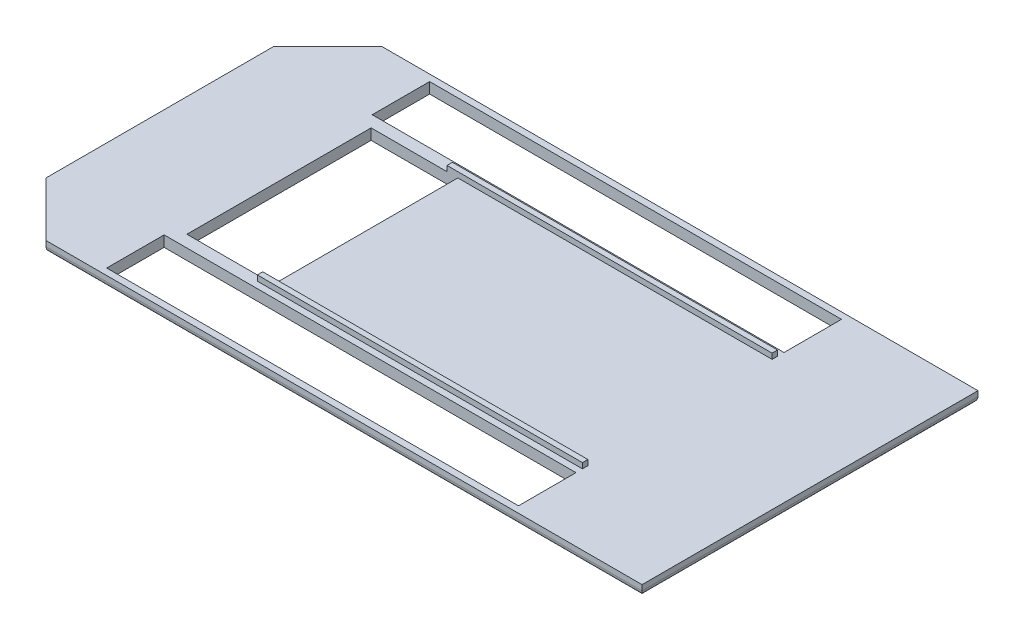
ISO-10303-21;
HEADER;
FILE_DESCRIPTION(('STEP AP214'),'2;1');
FILE_NAME('part.step','',(''),(''),'','','');
FILE_SCHEMA(('AUTOMOTIVE_DESIGN { 1 0 10303 214 1 1 1 1 }'));
ENDSEC;
DATA;
#1=APPLICATION_CONTEXT('core data for automotive mechanical design processes');
#2=APPLICATION_PROTOCOL_DEFINITION('international standard','automotive_design',2000,#1);
#3=PRODUCT_CONTEXT('',#1,'mechanical');
#4=PRODUCT('Part','Part','',(#3));
#5=PRODUCT_RELATED_PRODUCT_CATEGORY('part','',(#4));
#6=PRODUCT_DEFINITION_FORMATION('','',#4);
#7=PRODUCT_DEFINITION_CONTEXT('part definition',#1,'design');
#8=PRODUCT_DEFINITION('design','',#6,#7);
#9=PRODUCT_DEFINITION_SHAPE('','',#8);
#10=(LENGTH_UNIT() NAMED_UNIT(*) SI_UNIT(.MILLI.,.METRE.));
#11=(NAMED_UNIT(*) PLANE_ANGLE_UNIT() SI_UNIT($,.RADIAN.));
#12=(NAMED_UNIT(*) SI_UNIT($,.STERADIAN.) SOLID_ANGLE_UNIT());
#13=UNCERTAINTY_MEASURE_WITH_UNIT(LENGTH_MEASURE(1.E-05),#10,'distance_accuracy_value','');
#14=(GEOMETRIC_REPRESENTATION_CONTEXT(3) GLOBAL_UNCERTAINTY_ASSIGNED_CONTEXT((#13)) GLOBAL_UNIT_ASSIGNED_CONTEXT((#10,
#11,#12)) REPRESENTATION_CONTEXT('',''));
#15=CARTESIAN_POINT('',(0.,0.,0.));
#16=DIRECTION('',(0.,0.,1.));
#17=DIRECTION('',(1.,0.,0.));
#18=AXIS2_PLACEMENT_3D('',#15,#16,#17);
#19=CARTESIAN_POINT('',(0.,10.,0.));
#20=DIRECTION('',(0.,1.,0.));
#21=DIRECTION('',(0.,0.,1.));
#22=AXIS2_PLACEMENT_3D('',#19,#20,#21);
#23=PLANE('',#22);
#24=DIRECTION('',(0.,0.,-1.));
#25=VECTOR('',#24,1.);
#26=CARTESIAN_POINT('',(180.,10.,-96.));
#27=LINE('',#26,#25);
#28=CARTESIAN_POINT('',(180.,10.,-96.));
#29=VERTEX_POINT('',#28);
#30=CARTESIAN_POINT('',(180.,10.,-149.));
#31=VERTEX_POINT('',#30);
#32=EDGE_CURVE('E56',#29,#31,#27,.T.);
#33=ORIENTED_EDGE('',*,*,#32,.F.);
#34=DIRECTION('',(1.,0.,0.));
#35=VECTOR('',#34,1.);
#36=CARTESIAN_POINT('',(180.,10.,-96.));
#37=LINE('',#36,#35);
#38=CARTESIAN_POINT('',(-200.,10.,-96.));
#39=VERTEX_POINT('',#38);
#40=EDGE_CURVE('E255',#39,#29,#37,.T.);
#41=ORIENTED_EDGE('',*,*,#40,.F.);
#42=DIRECTION('',(0.,0.,1.));
#43=VECTOR('',#42,1.);
#44=CARTESIAN_POINT('',(-200.,10.,-96.));
#45=LINE('',#44,#43);
#46=CARTESIAN_POINT('',(-200.,10.,-149.));
#47=VERTEX_POINT('',#46);
#48=EDGE_CURVE('E259',#47,#39,#45,.T.);
#49=ORIENTED_EDGE('',*,*,#48,.F.);
#50=DIRECTION('',(-1.,0.,0.));
#51=VECTOR('',#50,1.);
#52=CARTESIAN_POINT('',(180.,10.,-149.));
#53=LINE('',#52,#51);
#54=EDGE_CURVE('E268',#31,#47,#53,.T.);
#55=ORIENTED_EDGE('',*,*,#54,.F.);
#56=EDGE_LOOP('',(#33,#41,#49,#55));
#57=FACE_BOUND('',#56,.T.);
#58=DIRECTION('',(-1.,0.,0.));
#59=VECTOR('',#58,1.);
#60=CARTESIAN_POINT('',(180.,10.,96.));
#61=LINE('',#60,#59);
#62=CARTESIAN_POINT('',(180.,10.,96.));
#63=VERTEX_POINT('',#62);
#64=CARTESIAN_POINT('',(-200.,10.,96.));
#65=VERTEX_POINT('',#64);
#66=EDGE_CURVE('E64',#63,#65,#61,.T.);
#67=ORIENTED_EDGE('',*,*,#66,.F.);
#68=DIRECTION('',(0.,0.,-1.));
#69=VECTOR('',#68,1.);
#70=CARTESIAN_POINT('',(180.,10.,96.));
#71=LINE('',#70,#69);
#72=CARTESIAN_POINT('',(180.,10.,149.));
#73=VERTEX_POINT('',#72);
#74=EDGE_CURVE('E289',#73,#63,#71,.T.);
#75=ORIENTED_EDGE('',*,*,#74,.F.);
#76=DIRECTION('',(1.,0.,0.));
#77=VECTOR('',#76,1.);
#78=CARTESIAN_POINT('',(180.,10.,149.));
#79=LINE('',#78,#77);
#80=CARTESIAN_POINT('',(-200.,10.,149.));
#81=VERTEX_POINT('',#80);
#82=EDGE_CURVE('E309',#81,#73,#79,.T.);
#83=ORIENTED_EDGE('',*,*,#82,.F.);
#84=DIRECTION('',(0.,0.,1.));
#85=VECTOR('',#84,1.);
#86=CARTESIAN_POINT('',(-200.,10.,96.));
#87=LINE('',#86,#85);
#88=EDGE_CURVE('E304',#65,#81,#87,.T.);
#89=ORIENTED_EDGE('',*,*,#88,.F.);
#90=EDGE_LOOP('',(#67,#75,#83,#89));
#91=FACE_BOUND('',#90,.T.);
#92=DIRECTION('',(0.,0.,-1.));
#93=VECTOR('',#92,1.);
#94=CARTESIAN_POINT('',(-110.,10.,-85.));
#95=LINE('',#94,#93);
#96=CARTESIAN_POINT('',(-110.,10.,85.));
#97=VERTEX_POINT('',#96);
#98=CARTESIAN_POINT('',(-110.,10.,-85.));
#99=VERTEX_POINT('',#98);
#100=EDGE_CURVE('E351',#97,#99,#95,.T.);
#101=ORIENTED_EDGE('',*,*,#100,.F.);
#102=DIRECTION('',(-1.,0.,0.));
#103=VECTOR('',#102,1.);
#104=CARTESIAN_POINT('',(-120.,10.,85.));
#105=LINE('',#104,#103);
#106=CARTESIAN_POINT('',(180.,10.,85.));
#107=VERTEX_POINT('',#106);
#108=EDGE_CURVE('E416',#107,#97,#105,.T.);
#109=ORIENTED_EDGE('',*,*,#108,.F.);
#110=DIRECTION('',(0.,0.,-1.));
#111=VECTOR('',#110,1.);
#112=CARTESIAN_POINT('',(180.,10.,90.));
#113=LINE('',#112,#111);
#114=CARTESIAN_POINT('',(180.,10.,90.));
#115=VERTEX_POINT('',#114);
#116=EDGE_CURVE('E432',#115,#107,#113,.T.);
#117=ORIENTED_EDGE('',*,*,#116,.F.);
#118=DIRECTION('',(1.,0.,0.));
#119=VECTOR('',#118,1.);
#120=CARTESIAN_POINT('',(-120.,10.,90.));
#121=LINE('',#120,#119);
#122=CARTESIAN_POINT('',(-120.,10.,90.));
#123=VERTEX_POINT('',#122);
#124=EDGE_CURVE('E429',#123,#115,#121,.T.);
#125=ORIENTED_EDGE('',*,*,#124,.F.);
#126=DIRECTION('',(0.,0.,1.));
#127=VECTOR('',#126,1.);
#128=CARTESIAN_POINT('',(-120.,10.,85.));
#129=LINE('',#128,#127);
#130=CARTESIAN_POINT('',(-120.,10.,85.));
#131=VERTEX_POINT('',#130);
#132=EDGE_CURVE('E410',#131,#123,#129,.T.);
#133=ORIENTED_EDGE('',*,*,#132,.F.);
#134=DIRECTION('',(1.,0.,0.));
#135=VECTOR('',#134,1.);
#136=CARTESIAN_POINT('',(-190.,10.,85.));
#137=LINE('',#136,#135);
#138=CARTESIAN_POINT('',(-190.,10.,85.));
#139=VERTEX_POINT('',#138);
#140=EDGE_CURVE('E348',#139,#131,#137,.T.);
#141=ORIENTED_EDGE('',*,*,#140,.F.);
#142=DIRECTION('',(0.,0.,1.));
#143=VECTOR('',#142,1.);
#144=CARTESIAN_POINT('',(-190.,10.,-85.));
#145=LINE('',#144,#143);
#146=CARTESIAN_POINT('',(-190.,10.,-85.));
#147=VERTEX_POINT('',#146);
#148=EDGE_CURVE('E344',#147,#139,#145,.T.);
#149=ORIENTED_EDGE('',*,*,#148,.F.);
#150=DIRECTION('',(-1.,0.,0.));
#151=VECTOR('',#150,1.);
#152=CARTESIAN_POINT('',(-190.,10.,-85.));
#153=LINE('',#152,#151);
#154=CARTESIAN_POINT('',(-120.,10.,-85.));
#155=VERTEX_POINT('',#154);
#156=EDGE_CURVE('E331',#155,#147,#153,.T.);
#157=ORIENTED_EDGE('',*,*,#156,.F.);
#158=DIRECTION('',(0.,0.,1.));
#159=VECTOR('',#158,1.);
#160=CARTESIAN_POINT('',(-120.,10.,-85.));
#161=LINE('',#160,#159);
#162=CARTESIAN_POINT('',(-120.,10.,-90.));
#163=VERTEX_POINT('',#162);
#164=EDGE_CURVE('E383',#163,#155,#161,.T.);
#165=ORIENTED_EDGE('',*,*,#164,.F.);
#166=DIRECTION('',(-1.,0.,0.));
#167=VECTOR('',#166,1.);
#168=CARTESIAN_POINT('',(-120.,10.,-90.));
#169=LINE('',#168,#167);
#170=CARTESIAN_POINT('',(180.,10.,-90.));
#171=VERTEX_POINT('',#170);
#172=EDGE_CURVE('E373',#171,#163,#169,.T.);
#173=ORIENTED_EDGE('',*,*,#172,.F.);
#174=DIRECTION('',(0.,0.,-1.));
#175=VECTOR('',#174,1.);
#176=CARTESIAN_POINT('',(180.,10.,-90.));
#177=LINE('',#176,#175);
#178=CARTESIAN_POINT('',(180.,10.,-85.));
#179=VERTEX_POINT('',#178);
#180=EDGE_CURVE('E390',#179,#171,#177,.T.);
#181=ORIENTED_EDGE('',*,*,#180,.F.);
#182=DIRECTION('',(1.,0.,0.));
#183=VECTOR('',#182,1.);
#184=CARTESIAN_POINT('',(-120.,10.,-85.));
#185=LINE('',#184,#183);
#186=EDGE_CURVE('E387',#99,#179,#185,.T.);
#187=ORIENTED_EDGE('',*,*,#186,.F.);
#188=EDGE_LOOP('',(#101,#109,#117,#125,#133,#141,#149,#157,#165,#173,#181,#187));
#189=FACE_BOUND('',#188,.T.);
#190=DIRECTION('',(0.,0.,-1.));
#191=VECTOR('',#190,1.);
#192=CARTESIAN_POINT('',(300.,10.,-155.));
#193=LINE('',#192,#191);
#194=CARTESIAN_POINT('',(300.,10.,155.));
#195=VERTEX_POINT('',#194);
#196=CARTESIAN_POINT('',(300.,10.,-155.));
#197=VERTEX_POINT('',#196);
#198=EDGE_CURVE('E452',#195,#197,#193,.T.);
#199=ORIENTED_EDGE('',*,*,#198,.T.);
#200=DIRECTION('',(-1.,0.,0.));
#201=VECTOR('',#200,1.);
#202=CARTESIAN_POINT('',(-250.,10.,-155.));
#203=LINE('',#202,#201);
#204=CARTESIAN_POINT('',(-250.,10.,-155.));
#205=VERTEX_POINT('',#204);
#206=EDGE_CURVE('E456',#197,#205,#203,.T.);
#207=ORIENTED_EDGE('',*,*,#206,.T.);
#208=DIRECTION('',(-0.707106781186547,0.,0.707106781186548));
#209=VECTOR('',#208,1.);
#210=CARTESIAN_POINT('',(-300.,10.,-105.));
#211=LINE('',#210,#209);
#212=CARTESIAN_POINT('',(-300.,10.,-105.));
#213=VERTEX_POINT('',#212);
#214=EDGE_CURVE('E459',#205,#213,#211,.T.);
#215=ORIENTED_EDGE('',*,*,#214,.T.);
#216=DIRECTION('',(0.,0.,1.));
#217=VECTOR('',#216,1.);
#218=CARTESIAN_POINT('',(-300.,10.,-105.));
#219=LINE('',#218,#217);
#220=CARTESIAN_POINT('',(-300.,10.,105.));
#221=VERTEX_POINT('',#220);
#222=EDGE_CURVE('E462',#213,#221,#219,.T.);
#223=ORIENTED_EDGE('',*,*,#222,.T.);
#224=DIRECTION('',(0.707106781186547,0.,0.707106781186548));
#225=VECTOR('',#224,1.);
#226=CARTESIAN_POINT('',(-300.,10.,105.));
#227=LINE('',#226,#225);
#228=CARTESIAN_POINT('',(-250.,10.,155.));
#229=VERTEX_POINT('',#228);
#230=EDGE_CURVE('E465',#221,#229,#227,.T.);
#231=ORIENTED_EDGE('',*,*,#230,.T.);
#232=DIRECTION('',(1.,0.,0.));
#233=VECTOR('',#232,1.);
#234=CARTESIAN_POINT('',(-250.,10.,155.));
#235=LINE('',#234,#233);
#236=EDGE_CURVE('E468',#229,#195,#235,.T.);
#237=ORIENTED_EDGE('',*,*,#236,.T.);
#238=EDGE_LOOP('',(#199,#207,#215,#223,#231,#237));
#239=FACE_BOUND('',#238,.T.);
#240=ADVANCED_FACE('F38',(#57,#91,#189,#239),#23,.T.);
#241=CARTESIAN_POINT('',(300.,10.,-155.));
#242=DIRECTION('',(-1.,0.,0.));
#243=DIRECTION('',(0.,0.,1.));
#244=AXIS2_PLACEMENT_3D('',#241,#242,#243);
#245=PLANE('',#244);
#246=DIRECTION('',(0.,-1.,0.));
#247=VECTOR('',#246,1.);
#248=CARTESIAN_POINT('',(300.,10.,155.));
#249=LINE('',#248,#247);
#250=CARTESIAN_POINT('',(300.,5.,155.));
#251=VERTEX_POINT('',#250);
#252=EDGE_CURVE('E471',#195,#251,#249,.T.);
#253=ORIENTED_EDGE('',*,*,#252,.T.);
#254=DIRECTION('',(0.,0.,-1.));
#255=VECTOR('',#254,1.);
#256=CARTESIAN_POINT('',(300.,5.,-155.));
#257=LINE('',#256,#255);
#258=CARTESIAN_POINT('',(300.,5.,-155.));
#259=VERTEX_POINT('',#258);
#260=EDGE_CURVE('E11',#251,#259,#257,.T.);
#261=ORIENTED_EDGE('',*,*,#260,.T.);
#262=DIRECTION('',(0.,-1.,0.));
#263=VECTOR('',#262,1.);
#264=CARTESIAN_POINT('',(300.,10.,-155.));
#265=LINE('',#264,#263);
#266=EDGE_CURVE('E491',#197,#259,#265,.T.);
#267=ORIENTED_EDGE('',*,*,#266,.F.);
#268=ORIENTED_EDGE('',*,*,#198,.F.);
#269=EDGE_LOOP('',(#253,#261,#267,#268));
#270=FACE_BOUND('',#269,.T.);
#271=ADVANCED_FACE('F570',(#270),#245,.F.);
#272=CARTESIAN_POINT('',(-250.,10.,-155.));
#273=DIRECTION('',(0.,0.,1.));
#274=DIRECTION('',(1.,0.,0.));
#275=AXIS2_PLACEMENT_3D('',#272,#273,#274);
#276=PLANE('',#275);
#277=ORIENTED_EDGE('',*,*,#266,.T.);
#278=DIRECTION('',(-1.,0.,0.));
#279=VECTOR('',#278,1.);
#280=CARTESIAN_POINT('',(-250.,5.,-155.));
#281=LINE('',#280,#279);
#282=CARTESIAN_POINT('',(-250.,5.,-155.));
#283=VERTEX_POINT('',#282);
#284=EDGE_CURVE('E495',#259,#283,#281,.T.);
#285=ORIENTED_EDGE('',*,*,#284,.T.);
#286=DIRECTION('',(0.,-1.,0.));
#287=VECTOR('',#286,1.);
#288=CARTESIAN_POINT('',(-250.,10.,-155.));
#289=LINE('',#288,#287);
#290=EDGE_CURVE('E487',#205,#283,#289,.T.);
#291=ORIENTED_EDGE('',*,*,#290,.F.);
#292=ORIENTED_EDGE('',*,*,#206,.F.);
#293=EDGE_LOOP('',(#277,#285,#291,#292));
#294=FACE_BOUND('',#293,.T.);
#295=ADVANCED_FACE('F574',(#294),#276,.F.);
#296=CARTESIAN_POINT('',(-300.,10.,-105.));
#297=DIRECTION('',(0.707106781186548,0.,0.707106781186547));
#298=DIRECTION('',(0.707106781186547,0.,-0.707106781186548));
#299=AXIS2_PLACEMENT_3D('',#296,#297,#298);
#300=PLANE('',#299);
#301=ORIENTED_EDGE('',*,*,#290,.T.);
#302=DIRECTION('',(-0.707106781186547,0.,0.707106781186548));
#303=VECTOR('',#302,1.);
#304=CARTESIAN_POINT('',(-300.,5.,-105.));
#305=LINE('',#304,#303);
#306=CARTESIAN_POINT('',(-300.,5.,-105.));
#307=VERTEX_POINT('',#306);
#308=EDGE_CURVE('E518',#283,#307,#305,.T.);
#309=ORIENTED_EDGE('',*,*,#308,.T.);
#310=DIRECTION('',(0.,-1.,0.));
#311=VECTOR('',#310,1.);
#312=CARTESIAN_POINT('',(-300.,10.,-105.));
#313=LINE('',#312,#311);
#314=EDGE_CURVE('E483',#213,#307,#313,.T.);
#315=ORIENTED_EDGE('',*,*,#314,.F.);
#316=ORIENTED_EDGE('',*,*,#214,.F.);
#317=EDGE_LOOP('',(#301,#309,#315,#316));
#318=FACE_BOUND('',#317,.T.);
#319=ADVANCED_FACE('F630',(#318),#300,.F.);
#320=CARTESIAN_POINT('',(-300.,10.,-105.));
#321=DIRECTION('',(1.,0.,0.));
#322=DIRECTION('',(0.,0.,-1.));
#323=AXIS2_PLACEMENT_3D('',#320,#321,#322);
#324=PLANE('',#323);
#325=ORIENTED_EDGE('',*,*,#314,.T.);
#326=DIRECTION('',(0.,0.,1.));
#327=VECTOR('',#326,1.);
#328=CARTESIAN_POINT('',(-300.,5.,-105.));
#329=LINE('',#328,#327);
#330=CARTESIAN_POINT('',(-300.,5.,105.));
#331=VERTEX_POINT('',#330);
#332=EDGE_CURVE('E521',#307,#331,#329,.T.);
#333=ORIENTED_EDGE('',*,*,#332,.T.);
#334=DIRECTION('',(0.,-1.,0.));
#335=VECTOR('',#334,1.);
#336=CARTESIAN_POINT('',(-300.,10.,105.));
#337=LINE('',#336,#335);
#338=EDGE_CURVE('E479',#221,#331,#337,.T.);
#339=ORIENTED_EDGE('',*,*,#338,.F.);
#340=ORIENTED_EDGE('',*,*,#222,.F.);
#341=EDGE_LOOP('',(#325,#333,#339,#340));
#342=FACE_BOUND('',#341,.T.);
#343=ADVANCED_FACE('F588',(#342),#324,.F.);
#344=CARTESIAN_POINT('',(-300.,10.,105.));
#345=DIRECTION('',(0.707106781186548,0.,-0.707106781186547));
#346=DIRECTION('',(-0.707106781186547,0.,-0.707106781186548));
#347=AXIS2_PLACEMENT_3D('',#344,#345,#346);
#348=PLANE('',#347);
#349=ORIENTED_EDGE('',*,*,#338,.T.);
#350=DIRECTION('',(0.707106781186547,0.,0.707106781186548));
#351=VECTOR('',#350,1.);
#352=CARTESIAN_POINT('',(-300.,5.,105.));
#353=LINE('',#352,#351);
#354=CARTESIAN_POINT('',(-250.,5.,155.));
#355=VERTEX_POINT('',#354);
#356=EDGE_CURVE('E524',#331,#355,#353,.T.);
#357=ORIENTED_EDGE('',*,*,#356,.T.);
#358=DIRECTION('',(0.,-1.,0.));
#359=VECTOR('',#358,1.);
#360=CARTESIAN_POINT('',(-250.,10.,155.));
#361=LINE('',#360,#359);
#362=EDGE_CURVE('E475',#229,#355,#361,.T.);
#363=ORIENTED_EDGE('',*,*,#362,.F.);
#364=ORIENTED_EDGE('',*,*,#230,.F.);
#365=EDGE_LOOP('',(#349,#357,#363,#364));
#366=FACE_BOUND('',#365,.T.);
#367=ADVANCED_FACE('F584',(#366),#348,.F.);
#368=CARTESIAN_POINT('',(-250.,10.,155.));
#369=DIRECTION('',(0.,0.,-1.));
#370=DIRECTION('',(-1.,0.,0.));
#371=AXIS2_PLACEMENT_3D('',#368,#369,#370);
#372=PLANE('',#371);
#373=ORIENTED_EDGE('',*,*,#362,.T.);
#374=DIRECTION('',(1.,0.,0.));
#375=VECTOR('',#374,1.);
#376=CARTESIAN_POINT('',(-250.,5.,155.));
#377=LINE('',#376,#375);
#378=EDGE_CURVE('E48',#355,#251,#377,.T.);
#379=ORIENTED_EDGE('',*,*,#378,.T.);
#380=ORIENTED_EDGE('',*,*,#252,.F.);
#381=ORIENTED_EDGE('',*,*,#236,.F.);
#382=EDGE_LOOP('',(#373,#379,#380,#381));
#383=FACE_BOUND('',#382,.T.);
#384=ADVANCED_FACE('F582',(#383),#372,.F.);
#385=CARTESIAN_POINT('',(0.,0.,0.));
#386=DIRECTION('',(0.,1.,0.));
#387=DIRECTION('',(0.,0.,1.));
#388=AXIS2_PLACEMENT_3D('',#385,#386,#387);
#389=PLANE('',#388);
#390=DIRECTION('',(1.,0.,0.));
#391=VECTOR('',#390,1.);
#392=CARTESIAN_POINT('',(180.,0.,-96.));
#393=LINE('',#392,#391);
#394=CARTESIAN_POINT('',(-200.,0.,-96.));
#395=VERTEX_POINT('',#394);
#396=CARTESIAN_POINT('',(180.,0.,-96.));
#397=VERTEX_POINT('',#396);
#398=EDGE_CURVE('E240',#395,#397,#393,.T.);
#399=ORIENTED_EDGE('',*,*,#398,.T.);
#400=DIRECTION('',(0.,0.,-1.));
#401=VECTOR('',#400,1.);
#402=CARTESIAN_POINT('',(180.,0.,-96.));
#403=LINE('',#402,#401);
#404=CARTESIAN_POINT('',(180.,0.,-149.));
#405=VERTEX_POINT('',#404);
#406=EDGE_CURVE('E233',#397,#405,#403,.T.);
#407=ORIENTED_EDGE('',*,*,#406,.T.);
#408=DIRECTION('',(-1.,0.,0.));
#409=VECTOR('',#408,1.);
#410=CARTESIAN_POINT('',(180.,0.,-149.));
#411=LINE('',#410,#409);
#412=CARTESIAN_POINT('',(-200.,0.,-149.));
#413=VERTEX_POINT('',#412);
#414=EDGE_CURVE('E244',#405,#413,#411,.T.);
#415=ORIENTED_EDGE('',*,*,#414,.T.);
#416=DIRECTION('',(0.,0.,1.));
#417=VECTOR('',#416,1.);
#418=CARTESIAN_POINT('',(-200.,0.,-96.));
#419=LINE('',#418,#417);
#420=EDGE_CURVE('E249',#413,#395,#419,.T.);
#421=ORIENTED_EDGE('',*,*,#420,.T.);
#422=EDGE_LOOP('',(#399,#407,#415,#421));
#423=FACE_BOUND('',#422,.T.);
#424=DIRECTION('',(0.,0.,-1.));
#425=VECTOR('',#424,1.);
#426=CARTESIAN_POINT('',(180.,0.,96.));
#427=LINE('',#426,#425);
#428=CARTESIAN_POINT('',(180.,0.,149.));
#429=VERTEX_POINT('',#428);
#430=CARTESIAN_POINT('',(180.,0.,96.));
#431=VERTEX_POINT('',#430);
#432=EDGE_CURVE('E297',#429,#431,#427,.T.);
#433=ORIENTED_EDGE('',*,*,#432,.T.);
#434=DIRECTION('',(-1.,0.,0.));
#435=VECTOR('',#434,1.);
#436=CARTESIAN_POINT('',(180.,0.,96.));
#437=LINE('',#436,#435);
#438=CARTESIAN_POINT('',(-200.,0.,96.));
#439=VERTEX_POINT('',#438);
#440=EDGE_CURVE('E284',#431,#439,#437,.T.);
#441=ORIENTED_EDGE('',*,*,#440,.T.);
#442=DIRECTION('',(0.,0.,1.));
#443=VECTOR('',#442,1.);
#444=CARTESIAN_POINT('',(-200.,0.,96.));
#445=LINE('',#444,#443);
#446=CARTESIAN_POINT('',(-200.,0.,149.));
#447=VERTEX_POINT('',#446);
#448=EDGE_CURVE('E288',#439,#447,#445,.T.);
#449=ORIENTED_EDGE('',*,*,#448,.T.);
#450=DIRECTION('',(1.,0.,0.));
#451=VECTOR('',#450,1.);
#452=CARTESIAN_POINT('',(180.,0.,149.));
#453=LINE('',#452,#451);
#454=EDGE_CURVE('E293',#447,#429,#453,.T.);
#455=ORIENTED_EDGE('',*,*,#454,.T.);
#456=EDGE_LOOP('',(#433,#441,#449,#455));
#457=FACE_BOUND('',#456,.T.);
#458=DIRECTION('',(-1.,0.,0.));
#459=VECTOR('',#458,1.);
#460=CARTESIAN_POINT('',(-190.,0.,-85.));
#461=LINE('',#460,#459);
#462=CARTESIAN_POINT('',(-110.,0.,-85.));
#463=VERTEX_POINT('',#462);
#464=CARTESIAN_POINT('',(-190.,0.,-85.));
#465=VERTEX_POINT('',#464);
#466=EDGE_CURVE('E339',#463,#465,#461,.T.);
#467=ORIENTED_EDGE('',*,*,#466,.T.);
#468=DIRECTION('',(0.,0.,1.));
#469=VECTOR('',#468,1.);
#470=CARTESIAN_POINT('',(-190.,0.,-85.));
#471=LINE('',#470,#469);
#472=CARTESIAN_POINT('',(-190.,0.,85.));
#473=VERTEX_POINT('',#472);
#474=EDGE_CURVE('E326',#465,#473,#471,.T.);
#475=ORIENTED_EDGE('',*,*,#474,.T.);
#476=DIRECTION('',(1.,0.,0.));
#477=VECTOR('',#476,1.);
#478=CARTESIAN_POINT('',(-190.,0.,85.));
#479=LINE('',#478,#477);
#480=CARTESIAN_POINT('',(-110.,0.,85.));
#481=VERTEX_POINT('',#480);
#482=EDGE_CURVE('E330',#473,#481,#479,.T.);
#483=ORIENTED_EDGE('',*,*,#482,.T.);
#484=DIRECTION('',(0.,0.,-1.));
#485=VECTOR('',#484,1.);
#486=CARTESIAN_POINT('',(-110.,0.,-85.));
#487=LINE('',#486,#485);
#488=EDGE_CURVE('E335',#481,#463,#487,.T.);
#489=ORIENTED_EDGE('',*,*,#488,.T.);
#490=EDGE_LOOP('',(#467,#475,#483,#489));
#491=FACE_BOUND('',#490,.T.);
#492=DIRECTION('',(-0.707106781186547,0.,0.707106781186548));
#493=VECTOR('',#492,1.);
#494=CARTESIAN_POINT('',(-198.964466094067,0.,-198.964466094067));
#495=LINE('',#494,#493);
#496=CARTESIAN_POINT('',(-295.,0.,-102.928932188135));
#497=VERTEX_POINT('',#496);
#498=CARTESIAN_POINT('',(-247.928932188134,0.,-150.));
#499=VERTEX_POINT('',#498);
#500=EDGE_CURVE('E511',#497,#499,#495,.F.);
#501=ORIENTED_EDGE('',*,*,#500,.T.);
#502=DIRECTION('',(-1.,0.,0.));
#503=VECTOR('',#502,1.);
#504=CARTESIAN_POINT('',(0.,0.,-150.));
#505=LINE('',#504,#503);
#506=CARTESIAN_POINT('',(295.,0.,-150.));
#507=VERTEX_POINT('',#506);
#508=EDGE_CURVE('E514',#499,#507,#505,.F.);
#509=ORIENTED_EDGE('',*,*,#508,.T.);
#510=DIRECTION('',(0.,0.,-1.));
#511=VECTOR('',#510,1.);
#512=CARTESIAN_POINT('',(295.,0.,0.));
#513=LINE('',#512,#511);
#514=CARTESIAN_POINT('',(295.,0.,150.));
#515=VERTEX_POINT('',#514);
#516=EDGE_CURVE('E499',#507,#515,#513,.F.);
#517=ORIENTED_EDGE('',*,*,#516,.T.);
#518=DIRECTION('',(1.,0.,0.));
#519=VECTOR('',#518,1.);
#520=CARTESIAN_POINT('',(0.,0.,150.));
#521=LINE('',#520,#519);
#522=CARTESIAN_POINT('',(-247.928932188135,0.,150.));
#523=VERTEX_POINT('',#522);
#524=EDGE_CURVE('E502',#515,#523,#521,.F.);
#525=ORIENTED_EDGE('',*,*,#524,.T.);
#526=DIRECTION('',(0.707106781186547,0.,0.707106781186548));
#527=VECTOR('',#526,1.);
#528=CARTESIAN_POINT('',(-198.964466094067,0.,198.964466094067));
#529=LINE('',#528,#527);
#530=CARTESIAN_POINT('',(-295.,0.,102.928932188135));
#531=VERTEX_POINT('',#530);
#532=EDGE_CURVE('E505',#523,#531,#529,.F.);
#533=ORIENTED_EDGE('',*,*,#532,.T.);
#534=DIRECTION('',(0.,0.,1.));
#535=VECTOR('',#534,1.);
#536=CARTESIAN_POINT('',(-295.,0.,0.));
#537=LINE('',#536,#535);
#538=EDGE_CURVE('E508',#531,#497,#537,.F.);
#539=ORIENTED_EDGE('',*,*,#538,.T.);
#540=EDGE_LOOP('',(#501,#509,#517,#525,#533,#539));
#541=FACE_BOUND('',#540,.T.);
#542=ADVANCED_FACE('F251',(#423,#457,#491,#541),#389,.F.);
#543=CARTESIAN_POINT('',(-120.,15.,85.));
#544=DIRECTION('',(1.,0.,0.));
#545=DIRECTION('',(0.,0.,-1.));
#546=AXIS2_PLACEMENT_3D('',#543,#544,#545);
#547=PLANE('',#546);
#548=ORIENTED_EDGE('',*,*,#132,.T.);
#549=DIRECTION('',(0.,-1.,0.));
#550=VECTOR('',#549,1.);
#551=CARTESIAN_POINT('',(-120.,15.,90.));
#552=LINE('',#551,#550);
#553=CARTESIAN_POINT('',(-120.,15.,90.));
#554=VERTEX_POINT('',#553);
#555=EDGE_CURVE('E449',#554,#123,#552,.T.);
#556=ORIENTED_EDGE('',*,*,#555,.F.);
#557=DIRECTION('',(0.,0.,1.));
#558=VECTOR('',#557,1.);
#559=CARTESIAN_POINT('',(-120.,15.,85.));
#560=LINE('',#559,#558);
#561=CARTESIAN_POINT('',(-120.,15.,85.));
#562=VERTEX_POINT('',#561);
#563=EDGE_CURVE('E411',#562,#554,#560,.T.);
#564=ORIENTED_EDGE('',*,*,#563,.F.);
#565=DIRECTION('',(0.,-1.,0.));
#566=VECTOR('',#565,1.);
#567=CARTESIAN_POINT('',(-120.,15.,85.));
#568=LINE('',#567,#566);
#569=EDGE_CURVE('E425',#562,#131,#568,.T.);
#570=ORIENTED_EDGE('',*,*,#569,.T.);
#571=EDGE_LOOP('',(#548,#556,#564,#570));
#572=FACE_BOUND('',#571,.T.);
#573=ADVANCED_FACE('F621',(#572),#547,.F.);
#574=CARTESIAN_POINT('',(-120.,15.,90.));
#575=DIRECTION('',(0.,0.,-1.));
#576=DIRECTION('',(-1.,0.,0.));
#577=AXIS2_PLACEMENT_3D('',#574,#575,#576);
#578=PLANE('',#577);
#579=ORIENTED_EDGE('',*,*,#124,.T.);
#580=DIRECTION('',(0.,-1.,0.));
#581=VECTOR('',#580,1.);
#582=CARTESIAN_POINT('',(180.,15.,90.));
#583=LINE('',#582,#581);
#584=CARTESIAN_POINT('',(180.,15.,90.));
#585=VERTEX_POINT('',#584);
#586=EDGE_CURVE('E445',#585,#115,#583,.T.);
#587=ORIENTED_EDGE('',*,*,#586,.F.);
#588=DIRECTION('',(1.,0.,0.));
#589=VECTOR('',#588,1.);
#590=CARTESIAN_POINT('',(-120.,15.,90.));
#591=LINE('',#590,#589);
#592=EDGE_CURVE('E415',#554,#585,#591,.T.);
#593=ORIENTED_EDGE('',*,*,#592,.F.);
#594=ORIENTED_EDGE('',*,*,#555,.T.);
#595=EDGE_LOOP('',(#579,#587,#593,#594));
#596=FACE_BOUND('',#595,.T.);
#597=ADVANCED_FACE('F843',(#596),#578,.F.);
#598=CARTESIAN_POINT('',(180.,15.,90.));
#599=DIRECTION('',(-1.,0.,0.));
#600=DIRECTION('',(0.,0.,1.));
#601=AXIS2_PLACEMENT_3D('',#598,#599,#600);
#602=PLANE('',#601);
#603=ORIENTED_EDGE('',*,*,#116,.T.);
#604=DIRECTION('',(0.,-1.,0.));
#605=VECTOR('',#604,1.);
#606=CARTESIAN_POINT('',(180.,15.,85.));
#607=LINE('',#606,#605);
#608=CARTESIAN_POINT('',(180.,15.,85.));
#609=VERTEX_POINT('',#608);
#610=EDGE_CURVE('E442',#609,#107,#607,.T.);
#611=ORIENTED_EDGE('',*,*,#610,.F.);
#612=DIRECTION('',(0.,0.,-1.));
#613=VECTOR('',#612,1.);
#614=CARTESIAN_POINT('',(180.,15.,90.));
#615=LINE('',#614,#613);
#616=EDGE_CURVE('E419',#585,#609,#615,.T.);
#617=ORIENTED_EDGE('',*,*,#616,.F.);
#618=ORIENTED_EDGE('',*,*,#586,.T.);
#619=EDGE_LOOP('',(#603,#611,#617,#618));
#620=FACE_BOUND('',#619,.T.);
#621=ADVANCED_FACE('F710',(#620),#602,.F.);
#622=CARTESIAN_POINT('',(-120.,15.,85.));
#623=DIRECTION('',(0.,0.,1.));
#624=DIRECTION('',(1.,0.,0.));
#625=AXIS2_PLACEMENT_3D('',#622,#623,#624);
#626=PLANE('',#625);
#627=ORIENTED_EDGE('',*,*,#108,.T.);
#628=DIRECTION('',(0.,1.,0.));
#629=VECTOR('',#628,1.);
#630=CARTESIAN_POINT('',(-110.,0.,85.));
#631=LINE('',#630,#629);
#632=EDGE_CURVE('E363',#481,#97,#631,.T.);
#633=ORIENTED_EDGE('',*,*,#632,.F.);
#634=ORIENTED_EDGE('',*,*,#482,.F.);
#635=DIRECTION('',(0.,1.,0.));
#636=VECTOR('',#635,1.);
#637=CARTESIAN_POINT('',(-190.,0.,85.));
#638=LINE('',#637,#636);
#639=EDGE_CURVE('E343',#473,#139,#638,.T.);
#640=ORIENTED_EDGE('',*,*,#639,.T.);
#641=ORIENTED_EDGE('',*,*,#140,.T.);
#642=ORIENTED_EDGE('',*,*,#569,.F.);
#643=DIRECTION('',(-1.,0.,0.));
#644=VECTOR('',#643,1.);
#645=CARTESIAN_POINT('',(-120.,15.,85.));
#646=LINE('',#645,#644);
#647=EDGE_CURVE('E422',#609,#562,#646,.T.);
#648=ORIENTED_EDGE('',*,*,#647,.F.);
#649=ORIENTED_EDGE('',*,*,#610,.T.);
#650=EDGE_LOOP('',(#627,#633,#634,#640,#641,#642,#648,#649));
#651=FACE_BOUND('',#650,.T.);
#652=ADVANCED_FACE('F703',(#651),#626,.F.);
#653=CARTESIAN_POINT('',(0.,15.,0.));
#654=DIRECTION('',(0.,1.,0.));
#655=DIRECTION('',(0.,0.,1.));
#656=AXIS2_PLACEMENT_3D('',#653,#654,#655);
#657=PLANE('',#656);
#658=ORIENTED_EDGE('',*,*,#563,.T.);
#659=ORIENTED_EDGE('',*,*,#592,.T.);
#660=ORIENTED_EDGE('',*,*,#616,.T.);
#661=ORIENTED_EDGE('',*,*,#647,.T.);
#662=EDGE_LOOP('',(#658,#659,#660,#661));
#663=FACE_BOUND('',#662,.T.);
#664=ADVANCED_FACE('F709',(#663),#657,.T.);
#665=CARTESIAN_POINT('',(-120.,15.,-85.));
#666=DIRECTION('',(1.,0.,0.));
#667=DIRECTION('',(0.,0.,-1.));
#668=AXIS2_PLACEMENT_3D('',#665,#666,#667);
#669=PLANE('',#668);
#670=ORIENTED_EDGE('',*,*,#164,.T.);
#671=DIRECTION('',(0.,-1.,0.));
#672=VECTOR('',#671,1.);
#673=CARTESIAN_POINT('',(-120.,15.,-85.));
#674=LINE('',#673,#672);
#675=CARTESIAN_POINT('',(-120.,15.,-85.));
#676=VERTEX_POINT('',#675);
#677=EDGE_CURVE('E406',#676,#155,#674,.T.);
#678=ORIENTED_EDGE('',*,*,#677,.F.);
#679=DIRECTION('',(0.,0.,1.));
#680=VECTOR('',#679,1.);
#681=CARTESIAN_POINT('',(-120.,15.,-85.));
#682=LINE('',#681,#680);
#683=CARTESIAN_POINT('',(-120.,15.,-90.));
#684=VERTEX_POINT('',#683);
#685=EDGE_CURVE('E368',#684,#676,#682,.T.);
#686=ORIENTED_EDGE('',*,*,#685,.F.);
#687=DIRECTION('',(0.,-1.,0.));
#688=VECTOR('',#687,1.);
#689=CARTESIAN_POINT('',(-120.,15.,-90.));
#690=LINE('',#689,#688);
#691=EDGE_CURVE('E382',#684,#163,#690,.T.);
#692=ORIENTED_EDGE('',*,*,#691,.T.);
#693=EDGE_LOOP('',(#670,#678,#686,#692));
#694=FACE_BOUND('',#693,.T.);
#695=ADVANCED_FACE('F728',(#694),#669,.F.);
#696=CARTESIAN_POINT('',(-120.,15.,-85.));
#697=DIRECTION('',(0.,0.,-1.));
#698=DIRECTION('',(-1.,0.,0.));
#699=AXIS2_PLACEMENT_3D('',#696,#697,#698);
#700=PLANE('',#699);
#701=ORIENTED_EDGE('',*,*,#677,.T.);
#702=ORIENTED_EDGE('',*,*,#156,.T.);
#703=DIRECTION('',(0.,1.,0.));
#704=VECTOR('',#703,1.);
#705=CARTESIAN_POINT('',(-190.,0.,-85.));
#706=LINE('',#705,#704);
#707=EDGE_CURVE('E305',#465,#147,#706,.T.);
#708=ORIENTED_EDGE('',*,*,#707,.F.);
#709=ORIENTED_EDGE('',*,*,#466,.F.);
#710=DIRECTION('',(0.,1.,0.));
#711=VECTOR('',#710,1.);
#712=CARTESIAN_POINT('',(-110.,0.,-85.));
#713=LINE('',#712,#711);
#714=EDGE_CURVE('E359',#463,#99,#713,.T.);
#715=ORIENTED_EDGE('',*,*,#714,.T.);
#716=ORIENTED_EDGE('',*,*,#186,.T.);
#717=DIRECTION('',(0.,-1.,0.));
#718=VECTOR('',#717,1.);
#719=CARTESIAN_POINT('',(180.,15.,-85.));
#720=LINE('',#719,#718);
#721=CARTESIAN_POINT('',(180.,15.,-85.));
#722=VERTEX_POINT('',#721);
#723=EDGE_CURVE('E402',#722,#179,#720,.T.);
#724=ORIENTED_EDGE('',*,*,#723,.F.);
#725=DIRECTION('',(1.,0.,0.));
#726=VECTOR('',#725,1.);
#727=CARTESIAN_POINT('',(-120.,15.,-85.));
#728=LINE('',#727,#726);
#729=EDGE_CURVE('E372',#676,#722,#728,.T.);
#730=ORIENTED_EDGE('',*,*,#729,.F.);
#731=EDGE_LOOP('',(#701,#702,#708,#709,#715,#716,#724,#730));
#732=FACE_BOUND('',#731,.T.);
#733=ADVANCED_FACE('F720',(#732),#700,.F.);
#734=CARTESIAN_POINT('',(180.,15.,-90.));
#735=DIRECTION('',(-1.,0.,0.));
#736=DIRECTION('',(0.,0.,1.));
#737=AXIS2_PLACEMENT_3D('',#734,#735,#736);
#738=PLANE('',#737);
#739=ORIENTED_EDGE('',*,*,#180,.T.);
#740=DIRECTION('',(0.,-1.,0.));
#741=VECTOR('',#740,1.);
#742=CARTESIAN_POINT('',(180.,15.,-90.));
#743=LINE('',#742,#741);
#744=CARTESIAN_POINT('',(180.,15.,-90.));
#745=VERTEX_POINT('',#744);
#746=EDGE_CURVE('E399',#745,#171,#743,.T.);
#747=ORIENTED_EDGE('',*,*,#746,.F.);
#748=DIRECTION('',(0.,0.,-1.));
#749=VECTOR('',#748,1.);
#750=CARTESIAN_POINT('',(180.,15.,-90.));
#751=LINE('',#750,#749);
#752=EDGE_CURVE('E376',#722,#745,#751,.T.);
#753=ORIENTED_EDGE('',*,*,#752,.F.);
#754=ORIENTED_EDGE('',*,*,#723,.T.);
#755=EDGE_LOOP('',(#739,#747,#753,#754));
#756=FACE_BOUND('',#755,.T.);
#757=ADVANCED_FACE('F727',(#756),#738,.F.);
#758=CARTESIAN_POINT('',(-120.,15.,-90.));
#759=DIRECTION('',(0.,0.,1.));
#760=DIRECTION('',(1.,0.,0.));
#761=AXIS2_PLACEMENT_3D('',#758,#759,#760);
#762=PLANE('',#761);
#763=ORIENTED_EDGE('',*,*,#172,.T.);
#764=ORIENTED_EDGE('',*,*,#691,.F.);
#765=DIRECTION('',(-1.,0.,0.));
#766=VECTOR('',#765,1.);
#767=CARTESIAN_POINT('',(-120.,15.,-90.));
#768=LINE('',#767,#766);
#769=EDGE_CURVE('E379',#745,#684,#768,.T.);
#770=ORIENTED_EDGE('',*,*,#769,.F.);
#771=ORIENTED_EDGE('',*,*,#746,.T.);
#772=EDGE_LOOP('',(#763,#764,#770,#771));
#773=FACE_BOUND('',#772,.T.);
#774=ADVANCED_FACE('F829',(#773),#762,.F.);
#775=CARTESIAN_POINT('',(0.,15.,0.));
#776=DIRECTION('',(0.,-1.,0.));
#777=DIRECTION('',(0.,0.,-1.));
#778=AXIS2_PLACEMENT_3D('',#775,#776,#777);
#779=PLANE('',#778);
#780=ORIENTED_EDGE('',*,*,#685,.T.);
#781=ORIENTED_EDGE('',*,*,#729,.T.);
#782=ORIENTED_EDGE('',*,*,#752,.T.);
#783=ORIENTED_EDGE('',*,*,#769,.T.);
#784=EDGE_LOOP('',(#780,#781,#782,#783));
#785=FACE_BOUND('',#784,.T.);
#786=ADVANCED_FACE('F664',(#785),#779,.F.);
#787=CARTESIAN_POINT('',(-296.464466094067,5.,101.464466094067));
#788=DIRECTION('',(0.707106781186547,0.,0.707106781186548));
#789=DIRECTION('',(0.707106781186548,0.,-0.707106781186547));
#790=AXIS2_PLACEMENT_3D('',#787,#788,#789);
#791=CYLINDRICAL_SURFACE('',#790,5.);
#792=CARTESIAN_POINT('',(-295.,5.,102.928932188135));
#793=DIRECTION('',(0.38268343236509,0.,0.923879532511287));
#794=DIRECTION('',(0.923879532511287,0.,-0.38268343236509));
#795=AXIS2_PLACEMENT_3D('',#792,#793,#794);
#796=ELLIPSE('',#795,5.41196100146197,5.);
#797=EDGE_CURVE('E541',#531,#331,#796,.F.);
#798=ORIENTED_EDGE('',*,*,#797,.F.);
#799=ORIENTED_EDGE('',*,*,#532,.F.);
#800=CARTESIAN_POINT('',(-247.928932188134,5.,150.));
#801=DIRECTION('',(0.923879532511287,0.,0.38268343236509));
#802=DIRECTION('',(0.38268343236509,0.,-0.923879532511287));
#803=AXIS2_PLACEMENT_3D('',#800,#801,#802);
#804=ELLIPSE('',#803,5.41196100146197,5.);
#805=EDGE_CURVE('E42',#355,#523,#804,.T.);
#806=ORIENTED_EDGE('',*,*,#805,.F.);
#807=ORIENTED_EDGE('',*,*,#356,.F.);
#808=EDGE_LOOP('',(#798,#799,#806,#807));
#809=FACE_BOUND('',#808,.T.);
#810=ADVANCED_FACE('F40',(#809),#791,.T.);
#811=CARTESIAN_POINT('',(-250.,5.,150.));
#812=DIRECTION('',(1.,0.,0.));
#813=DIRECTION('',(0.,0.,-1.));
#814=AXIS2_PLACEMENT_3D('',#811,#812,#813);
#815=CYLINDRICAL_SURFACE('',#814,5.);
#816=ORIENTED_EDGE('',*,*,#805,.T.);
#817=ORIENTED_EDGE('',*,*,#524,.F.);
#818=CARTESIAN_POINT('',(295.,5.,150.));
#819=DIRECTION('',(0.707106781186547,0.,-0.707106781186547));
#820=DIRECTION('',(-0.707106781186548,0.,-0.707106781186547));
#821=AXIS2_PLACEMENT_3D('',#818,#819,#820);
#822=ELLIPSE('',#821,7.07106781186547,5.);
#823=EDGE_CURVE('E538',#251,#515,#822,.T.);
#824=ORIENTED_EDGE('',*,*,#823,.F.);
#825=ORIENTED_EDGE('',*,*,#378,.F.);
#826=EDGE_LOOP('',(#816,#817,#824,#825));
#827=FACE_BOUND('',#826,.T.);
#828=ADVANCED_FACE('F554',(#827),#815,.T.);
#829=CARTESIAN_POINT('',(-295.,5.,-105.));
#830=DIRECTION('',(0.,0.,1.));
#831=DIRECTION('',(1.,0.,0.));
#832=AXIS2_PLACEMENT_3D('',#829,#830,#831);
#833=CYLINDRICAL_SURFACE('',#832,5.);
#834=ORIENTED_EDGE('',*,*,#797,.T.);
#835=ORIENTED_EDGE('',*,*,#332,.F.);
#836=CARTESIAN_POINT('',(-295.,5.,-102.928932188135));
#837=DIRECTION('',(-0.38268343236509,0.,0.923879532511287));
#838=DIRECTION('',(0.923879532511287,0.,0.38268343236509));
#839=AXIS2_PLACEMENT_3D('',#836,#837,#838);
#840=ELLIPSE('',#839,5.41196100146197,5.);
#841=EDGE_CURVE('E534',#497,#307,#840,.F.);
#842=ORIENTED_EDGE('',*,*,#841,.F.);
#843=ORIENTED_EDGE('',*,*,#538,.F.);
#844=EDGE_LOOP('',(#834,#835,#842,#843));
#845=FACE_BOUND('',#844,.T.);
#846=ADVANCED_FACE('F590',(#845),#833,.T.);
#847=CARTESIAN_POINT('',(295.,5.,-155.));
#848=DIRECTION('',(0.,0.,-1.));
#849=DIRECTION('',(-1.,0.,0.));
#850=AXIS2_PLACEMENT_3D('',#847,#848,#849);
#851=CYLINDRICAL_SURFACE('',#850,5.);
#852=ORIENTED_EDGE('',*,*,#823,.T.);
#853=ORIENTED_EDGE('',*,*,#516,.F.);
#854=CARTESIAN_POINT('',(295.,5.,-150.));
#855=DIRECTION('',(-0.707106781186547,0.,-0.707106781186547));
#856=DIRECTION('',(0.707106781186547,0.,-0.707106781186547));
#857=AXIS2_PLACEMENT_3D('',#854,#855,#856);
#858=ELLIPSE('',#857,7.07106781186547,5.);
#859=EDGE_CURVE('E531',#259,#507,#858,.T.);
#860=ORIENTED_EDGE('',*,*,#859,.F.);
#861=ORIENTED_EDGE('',*,*,#260,.F.);
#862=EDGE_LOOP('',(#852,#853,#860,#861));
#863=FACE_BOUND('',#862,.T.);
#864=ADVANCED_FACE('F565',(#863),#851,.T.);
#865=CARTESIAN_POINT('',(-296.464466094067,5.,-101.464466094067));
#866=DIRECTION('',(-0.707106781186547,0.,0.707106781186548));
#867=DIRECTION('',(0.707106781186548,0.,0.707106781186547));
#868=AXIS2_PLACEMENT_3D('',#865,#866,#867);
#869=CYLINDRICAL_SURFACE('',#868,5.);
#870=ORIENTED_EDGE('',*,*,#841,.T.);
#871=ORIENTED_EDGE('',*,*,#308,.F.);
#872=CARTESIAN_POINT('',(-247.928932188134,5.,-150.));
#873=DIRECTION('',(-0.923879532511287,0.,0.38268343236509));
#874=DIRECTION('',(0.38268343236509,0.,0.923879532511287));
#875=AXIS2_PLACEMENT_3D('',#872,#873,#874);
#876=ELLIPSE('',#875,5.41196100146197,5.);
#877=EDGE_CURVE('E278',#499,#283,#876,.F.);
#878=ORIENTED_EDGE('',*,*,#877,.F.);
#879=ORIENTED_EDGE('',*,*,#500,.F.);
#880=EDGE_LOOP('',(#870,#871,#878,#879));
#881=FACE_BOUND('',#880,.T.);
#882=ADVANCED_FACE('F594',(#881),#869,.T.);
#883=CARTESIAN_POINT('',(-250.,5.,-150.));
#884=DIRECTION('',(-1.,0.,0.));
#885=DIRECTION('',(0.,0.,1.));
#886=AXIS2_PLACEMENT_3D('',#883,#884,#885);
#887=CYLINDRICAL_SURFACE('',#886,5.);
#888=ORIENTED_EDGE('',*,*,#859,.T.);
#889=ORIENTED_EDGE('',*,*,#508,.F.);
#890=ORIENTED_EDGE('',*,*,#877,.T.);
#891=ORIENTED_EDGE('',*,*,#284,.F.);
#892=EDGE_LOOP('',(#888,#889,#890,#891));
#893=FACE_BOUND('',#892,.T.);
#894=ADVANCED_FACE('F597',(#893),#887,.T.);
#895=CARTESIAN_POINT('',(-190.,0.,-85.));
#896=DIRECTION('',(-1.,0.,0.));
#897=DIRECTION('',(0.,0.,1.));
#898=AXIS2_PLACEMENT_3D('',#895,#896,#897);
#899=PLANE('',#898);
#900=ORIENTED_EDGE('',*,*,#148,.T.);
#901=ORIENTED_EDGE('',*,*,#639,.F.);
#902=ORIENTED_EDGE('',*,*,#474,.F.);
#903=ORIENTED_EDGE('',*,*,#707,.T.);
#904=EDGE_LOOP('',(#900,#901,#902,#903));
#905=FACE_BOUND('',#904,.T.);
#906=ADVANCED_FACE('F599',(#905),#899,.F.);
#907=CARTESIAN_POINT('',(-110.,0.,-85.));
#908=DIRECTION('',(1.,0.,0.));
#909=DIRECTION('',(0.,0.,-1.));
#910=AXIS2_PLACEMENT_3D('',#907,#908,#909);
#911=PLANE('',#910);
#912=ORIENTED_EDGE('',*,*,#100,.T.);
#913=ORIENTED_EDGE('',*,*,#714,.F.);
#914=ORIENTED_EDGE('',*,*,#488,.F.);
#915=ORIENTED_EDGE('',*,*,#632,.T.);
#916=EDGE_LOOP('',(#912,#913,#914,#915));
#917=FACE_BOUND('',#916,.T.);
#918=ADVANCED_FACE('F606',(#917),#911,.F.);
#919=CARTESIAN_POINT('',(180.,0.,96.));
#920=DIRECTION('',(0.,0.,-1.));
#921=DIRECTION('',(-1.,0.,0.));
#922=AXIS2_PLACEMENT_3D('',#919,#920,#921);
#923=PLANE('',#922);
#924=ORIENTED_EDGE('',*,*,#66,.T.);
#925=DIRECTION('',(0.,1.,0.));
#926=VECTOR('',#925,1.);
#927=CARTESIAN_POINT('',(-200.,0.,96.));
#928=LINE('',#927,#926);
#929=EDGE_CURVE('E301',#439,#65,#928,.T.);
#930=ORIENTED_EDGE('',*,*,#929,.F.);
#931=ORIENTED_EDGE('',*,*,#440,.F.);
#932=DIRECTION('',(0.,1.,0.));
#933=VECTOR('',#932,1.);
#934=CARTESIAN_POINT('',(180.,0.,96.));
#935=LINE('',#934,#933);
#936=EDGE_CURVE('E269',#431,#63,#935,.T.);
#937=ORIENTED_EDGE('',*,*,#936,.T.);
#938=EDGE_LOOP('',(#924,#930,#931,#937));
#939=FACE_BOUND('',#938,.T.);
#940=ADVANCED_FACE('F746',(#939),#923,.F.);
#941=CARTESIAN_POINT('',(180.,0.,96.));
#942=DIRECTION('',(1.,0.,0.));
#943=DIRECTION('',(0.,0.,-1.));
#944=AXIS2_PLACEMENT_3D('',#941,#942,#943);
#945=PLANE('',#944);
#946=ORIENTED_EDGE('',*,*,#74,.T.);
#947=ORIENTED_EDGE('',*,*,#936,.F.);
#948=ORIENTED_EDGE('',*,*,#432,.F.);
#949=DIRECTION('',(0.,1.,0.));
#950=VECTOR('',#949,1.);
#951=CARTESIAN_POINT('',(180.,0.,149.));
#952=LINE('',#951,#950);
#953=EDGE_CURVE('E318',#429,#73,#952,.T.);
#954=ORIENTED_EDGE('',*,*,#953,.T.);
#955=EDGE_LOOP('',(#946,#947,#948,#954));
#956=FACE_BOUND('',#955,.T.);
#957=ADVANCED_FACE('F755',(#956),#945,.F.);
#958=CARTESIAN_POINT('',(180.,0.,149.));
#959=DIRECTION('',(0.,0.,1.));
#960=DIRECTION('',(1.,0.,0.));
#961=AXIS2_PLACEMENT_3D('',#958,#959,#960);
#962=PLANE('',#961);
#963=ORIENTED_EDGE('',*,*,#82,.T.);
#964=ORIENTED_EDGE('',*,*,#953,.F.);
#965=ORIENTED_EDGE('',*,*,#454,.F.);
#966=DIRECTION('',(0.,1.,0.));
#967=VECTOR('',#966,1.);
#968=CARTESIAN_POINT('',(-200.,0.,149.));
#969=LINE('',#968,#967);
#970=EDGE_CURVE('E321',#447,#81,#969,.T.);
#971=ORIENTED_EDGE('',*,*,#970,.T.);
#972=EDGE_LOOP('',(#963,#964,#965,#971));
#973=FACE_BOUND('',#972,.T.);
#974=ADVANCED_FACE('F763',(#973),#962,.F.);
#975=CARTESIAN_POINT('',(-200.,0.,96.));
#976=DIRECTION('',(-1.,0.,0.));
#977=DIRECTION('',(0.,0.,1.));
#978=AXIS2_PLACEMENT_3D('',#975,#976,#977);
#979=PLANE('',#978);
#980=ORIENTED_EDGE('',*,*,#88,.T.);
#981=ORIENTED_EDGE('',*,*,#970,.F.);
#982=ORIENTED_EDGE('',*,*,#448,.F.);
#983=ORIENTED_EDGE('',*,*,#929,.T.);
#984=EDGE_LOOP('',(#980,#981,#982,#983));
#985=FACE_BOUND('',#984,.T.);
#986=ADVANCED_FACE('F772',(#985),#979,.F.);
#987=CARTESIAN_POINT('',(180.,0.,-96.));
#988=DIRECTION('',(1.,0.,0.));
#989=DIRECTION('',(0.,0.,-1.));
#990=AXIS2_PLACEMENT_3D('',#987,#988,#989);
#991=PLANE('',#990);
#992=ORIENTED_EDGE('',*,*,#32,.T.);
#993=DIRECTION('',(0.,1.,0.));
#994=VECTOR('',#993,1.);
#995=CARTESIAN_POINT('',(180.,0.,-149.));
#996=LINE('',#995,#994);
#997=EDGE_CURVE('E229',#405,#31,#996,.T.);
#998=ORIENTED_EDGE('',*,*,#997,.F.);
#999=ORIENTED_EDGE('',*,*,#406,.F.);
#1000=DIRECTION('',(0.,1.,0.));
#1001=VECTOR('',#1000,1.);
#1002=CARTESIAN_POINT('',(180.,0.,-96.));
#1003=LINE('',#1002,#1001);
#1004=EDGE_CURVE('E275',#397,#29,#1003,.T.);
#1005=ORIENTED_EDGE('',*,*,#1004,.T.);
#1006=EDGE_LOOP('',(#992,#998,#999,#1005));
#1007=FACE_BOUND('',#1006,.T.);
#1008=ADVANCED_FACE('F231',(#1007),#991,.F.);
#1009=CARTESIAN_POINT('',(180.,0.,-96.));
#1010=DIRECTION('',(0.,0.,1.));
#1011=DIRECTION('',(1.,0.,0.));
#1012=AXIS2_PLACEMENT_3D('',#1009,#1010,#1011);
#1013=PLANE('',#1012);
#1014=ORIENTED_EDGE('',*,*,#40,.T.);
#1015=ORIENTED_EDGE('',*,*,#1004,.F.);
#1016=ORIENTED_EDGE('',*,*,#398,.F.);
#1017=DIRECTION('',(0.,1.,0.));
#1018=VECTOR('',#1017,1.);
#1019=CARTESIAN_POINT('',(-200.,0.,-96.));
#1020=LINE('',#1019,#1018);
#1021=EDGE_CURVE('E279',#395,#39,#1020,.T.);
#1022=ORIENTED_EDGE('',*,*,#1021,.T.);
#1023=EDGE_LOOP('',(#1014,#1015,#1016,#1022));
#1024=FACE_BOUND('',#1023,.T.);
#1025=ADVANCED_FACE('F789',(#1024),#1013,.F.);
#1026=CARTESIAN_POINT('',(-200.,0.,-96.));
#1027=DIRECTION('',(-1.,0.,0.));
#1028=DIRECTION('',(0.,0.,1.));
#1029=AXIS2_PLACEMENT_3D('',#1026,#1027,#1028);
#1030=PLANE('',#1029);
#1031=ORIENTED_EDGE('',*,*,#48,.T.);
#1032=ORIENTED_EDGE('',*,*,#1021,.F.);
#1033=ORIENTED_EDGE('',*,*,#420,.F.);
#1034=DIRECTION('',(0.,1.,0.));
#1035=VECTOR('',#1034,1.);
#1036=CARTESIAN_POINT('',(-200.,0.,-149.));
#1037=LINE('',#1036,#1035);
#1038=EDGE_CURVE('E239',#413,#47,#1037,.T.);
#1039=ORIENTED_EDGE('',*,*,#1038,.T.);
#1040=EDGE_LOOP('',(#1031,#1032,#1033,#1039));
#1041=FACE_BOUND('',#1040,.T.);
#1042=ADVANCED_FACE('F797',(#1041),#1030,.F.);
#1043=CARTESIAN_POINT('',(180.,0.,-149.));
#1044=DIRECTION('',(0.,0.,-1.));
#1045=DIRECTION('',(-1.,0.,0.));
#1046=AXIS2_PLACEMENT_3D('',#1043,#1044,#1045);
#1047=PLANE('',#1046);
#1048=ORIENTED_EDGE('',*,*,#54,.T.);
#1049=ORIENTED_EDGE('',*,*,#1038,.F.);
#1050=ORIENTED_EDGE('',*,*,#414,.F.);
#1051=ORIENTED_EDGE('',*,*,#997,.T.);
#1052=EDGE_LOOP('',(#1048,#1049,#1050,#1051));
#1053=FACE_BOUND('',#1052,.T.);
#1054=ADVANCED_FACE('F245',(#1053),#1047,.F.);
#1055=CLOSED_SHELL('',(#240,#271,#295,#319,#343,#367,#384,#542,#573,#597,#621,#652,#664,#695,
#733,#757,#774,#786,#810,#828,#846,#864,#882,#894,#906,#918,#940,#957,#974,#986,#1008,#1025,
#1042,#1054));
#1056=MANIFOLD_SOLID_BREP('B2',#1055);
#1057=ADVANCED_BREP_SHAPE_REPRESENTATION('',(#18,#1056),#14);
#1058=SHAPE_DEFINITION_REPRESENTATION(#9,#1057);
ENDSEC;
END-ISO-10303-21;
